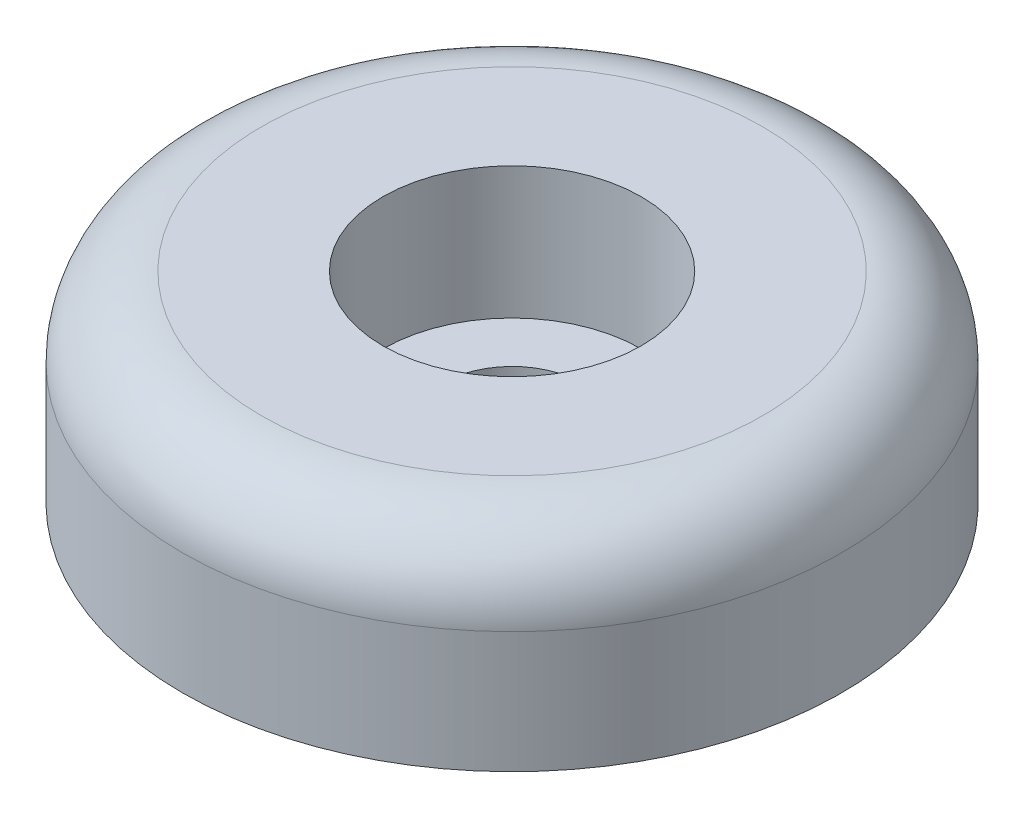
ISO-10303-21;
HEADER;
FILE_DESCRIPTION(('STEP AP214'),'2;1');
FILE_NAME('part.step','',(''),(''),'','','');
FILE_SCHEMA(('AUTOMOTIVE_DESIGN { 1 0 10303 214 1 1 1 1 }'));
ENDSEC;
DATA;
#1=APPLICATION_CONTEXT('core data for automotive mechanical design processes');
#2=APPLICATION_PROTOCOL_DEFINITION('international standard','automotive_design',2000,#1);
#3=PRODUCT_CONTEXT('',#1,'mechanical');
#4=PRODUCT('Part','Part','',(#3));
#5=PRODUCT_RELATED_PRODUCT_CATEGORY('part','',(#4));
#6=PRODUCT_DEFINITION_FORMATION('','',#4);
#7=PRODUCT_DEFINITION_CONTEXT('part definition',#1,'design');
#8=PRODUCT_DEFINITION('design','',#6,#7);
#9=PRODUCT_DEFINITION_SHAPE('','',#8);
#10=(LENGTH_UNIT() NAMED_UNIT(*) SI_UNIT(.MILLI.,.METRE.));
#11=(NAMED_UNIT(*) PLANE_ANGLE_UNIT() SI_UNIT($,.RADIAN.));
#12=(NAMED_UNIT(*) SI_UNIT($,.STERADIAN.) SOLID_ANGLE_UNIT());
#13=UNCERTAINTY_MEASURE_WITH_UNIT(LENGTH_MEASURE(1.E-05),#10,'distance_accuracy_value','');
#14=(GEOMETRIC_REPRESENTATION_CONTEXT(3) GLOBAL_UNCERTAINTY_ASSIGNED_CONTEXT((#13)) GLOBAL_UNIT_ASSIGNED_CONTEXT((#10,
#11,#12)) REPRESENTATION_CONTEXT('',''));
#15=CARTESIAN_POINT('',(0.,0.,0.));
#16=DIRECTION('',(0.,0.,1.));
#17=DIRECTION('',(1.,0.,0.));
#18=AXIS2_PLACEMENT_3D('',#15,#16,#17);
#19=CARTESIAN_POINT('',(0.,17.6756083370234,0.));
#20=DIRECTION('',(0.,1.,0.));
#21=DIRECTION('',(0.,0.,1.));
#22=AXIS2_PLACEMENT_3D('',#19,#20,#21);
#23=CYLINDRICAL_SURFACE('',#22,2.65);
#24=CARTESIAN_POINT('',(0.,2.6,0.));
#25=DIRECTION('',(0.,1.,0.));
#26=DIRECTION('',(0.,0.,1.));
#27=AXIS2_PLACEMENT_3D('',#24,#25,#26);
#28=CIRCLE('',#27,2.65);
#29=CARTESIAN_POINT('',(0.,2.6,2.65));
#30=VERTEX_POINT('',#29);
#31=EDGE_CURVE('E60',#30,#30,#28,.T.);
#32=ORIENTED_EDGE('',*,*,#31,.T.);
#33=EDGE_LOOP('',(#32));
#34=FACE_BOUND('',#33,.T.);
#35=CARTESIAN_POINT('',(0.,0.,0.));
#36=DIRECTION('',(0.,1.,0.));
#37=DIRECTION('',(0.,0.,1.));
#38=AXIS2_PLACEMENT_3D('',#35,#36,#37);
#39=CIRCLE('',#38,2.65);
#40=CARTESIAN_POINT('',(0.,0.,2.65));
#41=VERTEX_POINT('',#40);
#42=EDGE_CURVE('E45',#41,#41,#39,.T.);
#43=ORIENTED_EDGE('',*,*,#42,.F.);
#44=EDGE_LOOP('',(#43));
#45=FACE_BOUND('',#44,.T.);
#46=ADVANCED_FACE('F34',(#34,#45),#23,.F.);
#47=CARTESIAN_POINT('',(-2.65,0.,0.));
#48=DIRECTION('',(0.,-1.,0.));
#49=DIRECTION('',(0.,0.,-1.));
#50=AXIS2_PLACEMENT_3D('',#47,#48,#49);
#51=PLANE('',#50);
#52=ORIENTED_EDGE('',*,*,#42,.T.);
#53=EDGE_LOOP('',(#52));
#54=FACE_BOUND('',#53,.T.);
#55=CARTESIAN_POINT('',(0.,0.,0.));
#56=DIRECTION('',(0.,1.,0.));
#57=DIRECTION('',(0.,0.,1.));
#58=AXIS2_PLACEMENT_3D('',#55,#56,#57);
#59=CIRCLE('',#58,12.5);
#60=CARTESIAN_POINT('',(0.,0.,12.5));
#61=VERTEX_POINT('',#60);
#62=EDGE_CURVE('E49',#61,#61,#59,.T.);
#63=ORIENTED_EDGE('',*,*,#62,.F.);
#64=EDGE_LOOP('',(#63));
#65=FACE_BOUND('',#64,.T.);
#66=ADVANCED_FACE('F80',(#54,#65),#51,.T.);
#67=CARTESIAN_POINT('',(0.,17.6756083370234,0.));
#68=DIRECTION('',(0.,1.,0.));
#69=DIRECTION('',(0.,0.,1.));
#70=AXIS2_PLACEMENT_3D('',#67,#68,#69);
#71=CYLINDRICAL_SURFACE('',#70,12.5);
#72=CARTESIAN_POINT('',(0.,4.6,0.));
#73=DIRECTION('',(0.,1.,0.));
#74=DIRECTION('',(0.,0.,1.));
#75=AXIS2_PLACEMENT_3D('',#72,#73,#74);
#76=CIRCLE('',#75,12.5);
#77=CARTESIAN_POINT('',(0.,4.6,12.5));
#78=VERTEX_POINT('',#77);
#79=EDGE_CURVE('E10',#78,#78,#76,.F.);
#80=ORIENTED_EDGE('',*,*,#79,.T.);
#81=EDGE_LOOP('',(#80));
#82=FACE_BOUND('',#81,.T.);
#83=ORIENTED_EDGE('',*,*,#62,.T.);
#84=EDGE_LOOP('',(#83));
#85=FACE_BOUND('',#84,.T.);
#86=ADVANCED_FACE('F84',(#82,#85),#71,.T.);
#87=CARTESIAN_POINT('',(-12.5,7.6,0.));
#88=DIRECTION('',(0.,1.,0.));
#89=DIRECTION('',(0.,0.,1.));
#90=AXIS2_PLACEMENT_3D('',#87,#88,#89);
#91=PLANE('',#90);
#92=CARTESIAN_POINT('',(0.,7.6,0.));
#93=DIRECTION('',(0.,1.,0.));
#94=DIRECTION('',(0.,0.,1.));
#95=AXIS2_PLACEMENT_3D('',#92,#93,#94);
#96=CIRCLE('',#95,9.5);
#97=CARTESIAN_POINT('',(0.,7.6,9.5));
#98=VERTEX_POINT('',#97);
#99=EDGE_CURVE('E41',#98,#98,#96,.T.);
#100=ORIENTED_EDGE('',*,*,#99,.T.);
#101=EDGE_LOOP('',(#100));
#102=FACE_BOUND('',#101,.T.);
#103=CARTESIAN_POINT('',(0.,7.6,0.));
#104=DIRECTION('',(0.,1.,0.));
#105=DIRECTION('',(0.,0.,1.));
#106=AXIS2_PLACEMENT_3D('',#103,#104,#105);
#107=CIRCLE('',#106,4.9);
#108=CARTESIAN_POINT('',(0.,7.6,4.9));
#109=VERTEX_POINT('',#108);
#110=EDGE_CURVE('E54',#109,#109,#107,.T.);
#111=ORIENTED_EDGE('',*,*,#110,.F.);
#112=EDGE_LOOP('',(#111));
#113=FACE_BOUND('',#112,.T.);
#114=ADVANCED_FACE('F76',(#102,#113),#91,.T.);
#115=CARTESIAN_POINT('',(0.,17.6756083370234,0.));
#116=DIRECTION('',(0.,1.,0.));
#117=DIRECTION('',(0.,0.,1.));
#118=AXIS2_PLACEMENT_3D('',#115,#116,#117);
#119=CYLINDRICAL_SURFACE('',#118,4.9);
#120=ORIENTED_EDGE('',*,*,#110,.T.);
#121=EDGE_LOOP('',(#120));
#122=FACE_BOUND('',#121,.T.);
#123=CARTESIAN_POINT('',(0.,2.6,0.));
#124=DIRECTION('',(0.,1.,0.));
#125=DIRECTION('',(0.,0.,1.));
#126=AXIS2_PLACEMENT_3D('',#123,#124,#125);
#127=CIRCLE('',#126,4.9);
#128=CARTESIAN_POINT('',(0.,2.6,4.9));
#129=VERTEX_POINT('',#128);
#130=EDGE_CURVE('E57',#129,#129,#127,.T.);
#131=ORIENTED_EDGE('',*,*,#130,.F.);
#132=EDGE_LOOP('',(#131));
#133=FACE_BOUND('',#132,.T.);
#134=ADVANCED_FACE('F68',(#122,#133),#119,.F.);
#135=CARTESIAN_POINT('',(-4.9,2.6,0.));
#136=DIRECTION('',(0.,1.,0.));
#137=DIRECTION('',(0.,0.,1.));
#138=AXIS2_PLACEMENT_3D('',#135,#136,#137);
#139=PLANE('',#138);
#140=ORIENTED_EDGE('',*,*,#130,.T.);
#141=EDGE_LOOP('',(#140));
#142=FACE_BOUND('',#141,.T.);
#143=ORIENTED_EDGE('',*,*,#31,.F.);
#144=EDGE_LOOP('',(#143));
#145=FACE_BOUND('',#144,.T.);
#146=ADVANCED_FACE('F66',(#142,#145),#139,.T.);
#147=CARTESIAN_POINT('',(0.,4.6,0.));
#148=DIRECTION('',(0.,1.,0.));
#149=DIRECTION('',(0.,0.,1.));
#150=AXIS2_PLACEMENT_3D('',#147,#148,#149);
#151=TOROIDAL_SURFACE('',#150,9.5,3.);
#152=ORIENTED_EDGE('',*,*,#79,.F.);
#153=EDGE_LOOP('',(#152));
#154=FACE_BOUND('',#153,.T.);
#155=ORIENTED_EDGE('',*,*,#99,.F.);
#156=EDGE_LOOP('',(#155));
#157=FACE_BOUND('',#156,.T.);
#158=ADVANCED_FACE('F36',(#154,#157),#151,.T.);
#159=CLOSED_SHELL('',(#46,#66,#86,#114,#134,#146,#158));
#160=MANIFOLD_SOLID_BREP('B2',#159);
#161=ADVANCED_BREP_SHAPE_REPRESENTATION('',(#18,#160),#14);
#162=SHAPE_DEFINITION_REPRESENTATION(#9,#161);
ENDSEC;
END-ISO-10303-21;
